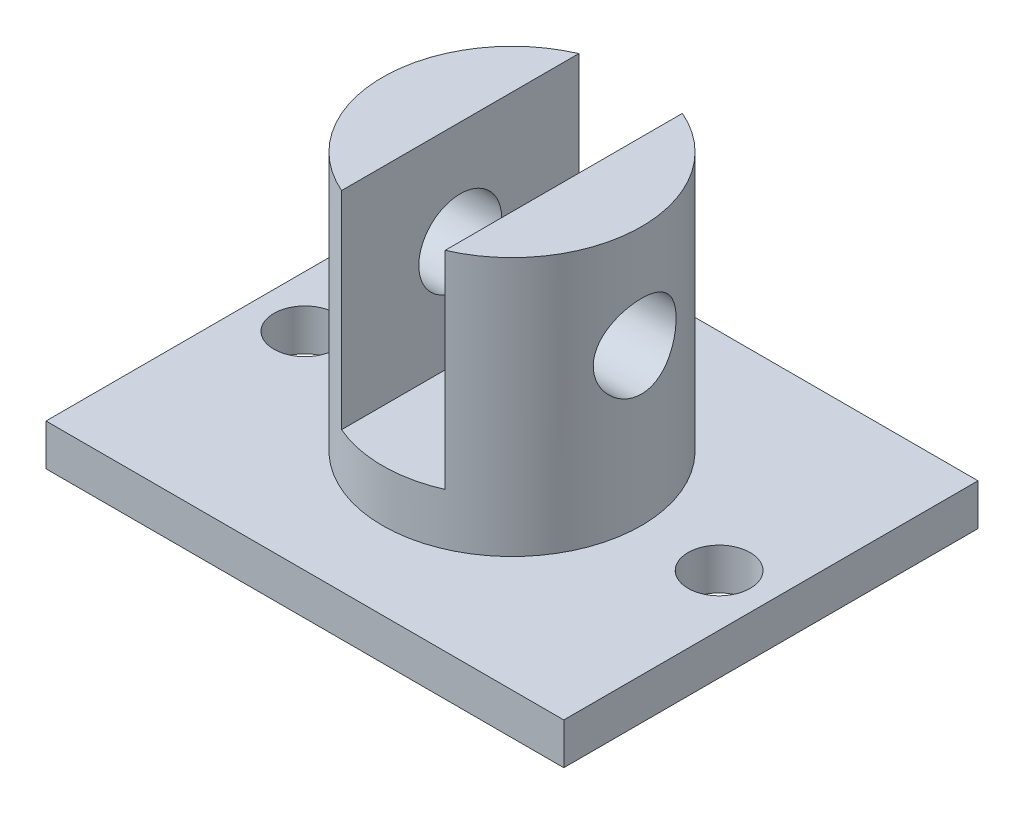
ISO-10303-21;
HEADER;
FILE_DESCRIPTION(('STEP AP214'),'2;1');
FILE_NAME('part.step','',(''),(''),'','','');
FILE_SCHEMA(('AUTOMOTIVE_DESIGN { 1 0 10303 214 1 1 1 1 }'));
ENDSEC;
DATA;
#1=APPLICATION_CONTEXT('core data for automotive mechanical design processes');
#2=APPLICATION_PROTOCOL_DEFINITION('international standard','automotive_design',2000,#1);
#3=PRODUCT_CONTEXT('',#1,'mechanical');
#4=PRODUCT('Part','Part','',(#3));
#5=PRODUCT_RELATED_PRODUCT_CATEGORY('part','',(#4));
#6=PRODUCT_DEFINITION_FORMATION('','',#4);
#7=PRODUCT_DEFINITION_CONTEXT('part definition',#1,'design');
#8=PRODUCT_DEFINITION('design','',#6,#7);
#9=PRODUCT_DEFINITION_SHAPE('','',#8);
#10=(LENGTH_UNIT() NAMED_UNIT(*) SI_UNIT(.MILLI.,.METRE.));
#11=(NAMED_UNIT(*) PLANE_ANGLE_UNIT() SI_UNIT($,.RADIAN.));
#12=(NAMED_UNIT(*) SI_UNIT($,.STERADIAN.) SOLID_ANGLE_UNIT());
#13=UNCERTAINTY_MEASURE_WITH_UNIT(LENGTH_MEASURE(1.E-05),#10,'distance_accuracy_value','');
#14=(GEOMETRIC_REPRESENTATION_CONTEXT(3) GLOBAL_UNCERTAINTY_ASSIGNED_CONTEXT((#13)) GLOBAL_UNIT_ASSIGNED_CONTEXT((#10,
#11,#12)) REPRESENTATION_CONTEXT('',''));
#15=CARTESIAN_POINT('',(0.,0.,0.));
#16=DIRECTION('',(0.,0.,1.));
#17=DIRECTION('',(1.,0.,0.));
#18=AXIS2_PLACEMENT_3D('',#15,#16,#17);
#19=CARTESIAN_POINT('',(0.,29.,0.));
#20=DIRECTION('',(0.,1.,0.));
#21=DIRECTION('',(0.,0.,1.));
#22=AXIS2_PLACEMENT_3D('',#19,#20,#21);
#23=PLANE('',#22);
#24=DIRECTION('',(0.,0.,-1.));
#25=VECTOR('',#24,1.);
#26=CARTESIAN_POINT('',(5.00000000000001,29.,0.));
#27=LINE('',#26,#25);
#28=CARTESIAN_POINT('',(5.00000000000001,29.,11.4564392373896));
#29=VERTEX_POINT('',#28);
#30=CARTESIAN_POINT('',(5.00000000000001,29.,-11.4564392373896));
#31=VERTEX_POINT('',#30);
#32=EDGE_CURVE('E120',#29,#31,#27,.T.);
#33=ORIENTED_EDGE('',*,*,#32,.F.);
#34=CARTESIAN_POINT('',(0.,29.,0.));
#35=DIRECTION('',(0.,1.,0.));
#36=DIRECTION('',(0.,0.,1.));
#37=AXIS2_PLACEMENT_3D('',#34,#35,#36);
#38=CIRCLE('',#37,12.5);
#39=EDGE_CURVE('E132',#29,#31,#38,.T.);
#40=ORIENTED_EDGE('',*,*,#39,.T.);
#41=EDGE_LOOP('',(#33,#40));
#42=FACE_BOUND('',#41,.T.);
#43=ADVANCED_FACE('F37',(#42),#23,.T.);
#44=CARTESIAN_POINT('',(25.,4.,-20.));
#45=DIRECTION('',(-1.,0.,0.));
#46=DIRECTION('',(0.,0.,1.));
#47=AXIS2_PLACEMENT_3D('',#44,#45,#46);
#48=PLANE('',#47);
#49=DIRECTION('',(0.,0.,-1.));
#50=VECTOR('',#49,1.);
#51=CARTESIAN_POINT('',(25.,0.,-20.));
#52=LINE('',#51,#50);
#53=CARTESIAN_POINT('',(25.,0.,20.));
#54=VERTEX_POINT('',#53);
#55=CARTESIAN_POINT('',(25.,0.,-20.));
#56=VERTEX_POINT('',#55);
#57=EDGE_CURVE('E136',#54,#56,#52,.T.);
#58=ORIENTED_EDGE('',*,*,#57,.T.);
#59=DIRECTION('',(0.,-1.,0.));
#60=VECTOR('',#59,1.);
#61=CARTESIAN_POINT('',(25.,4.,-20.));
#62=LINE('',#61,#60);
#63=CARTESIAN_POINT('',(25.,4.,-20.));
#64=VERTEX_POINT('',#63);
#65=EDGE_CURVE('E121',#64,#56,#62,.T.);
#66=ORIENTED_EDGE('',*,*,#65,.F.);
#67=DIRECTION('',(0.,0.,-1.));
#68=VECTOR('',#67,1.);
#69=CARTESIAN_POINT('',(25.,4.,-20.));
#70=LINE('',#69,#68);
#71=CARTESIAN_POINT('',(25.,4.,20.));
#72=VERTEX_POINT('',#71);
#73=EDGE_CURVE('E143',#72,#64,#70,.T.);
#74=ORIENTED_EDGE('',*,*,#73,.F.);
#75=DIRECTION('',(0.,-1.,0.));
#76=VECTOR('',#75,1.);
#77=CARTESIAN_POINT('',(25.,4.,20.));
#78=LINE('',#77,#76);
#79=EDGE_CURVE('E149',#72,#54,#78,.T.);
#80=ORIENTED_EDGE('',*,*,#79,.T.);
#81=EDGE_LOOP('',(#58,#66,#74,#80));
#82=FACE_BOUND('',#81,.T.);
#83=ADVANCED_FACE('F39',(#82),#48,.F.);
#84=CARTESIAN_POINT('',(-25.,4.,-20.));
#85=DIRECTION('',(0.,0.,1.));
#86=DIRECTION('',(1.,0.,0.));
#87=AXIS2_PLACEMENT_3D('',#84,#85,#86);
#88=PLANE('',#87);
#89=DIRECTION('',(-1.,0.,0.));
#90=VECTOR('',#89,1.);
#91=CARTESIAN_POINT('',(-25.,0.,-20.));
#92=LINE('',#91,#90);
#93=CARTESIAN_POINT('',(-25.,0.,-20.));
#94=VERTEX_POINT('',#93);
#95=EDGE_CURVE('E152',#56,#94,#92,.T.);
#96=ORIENTED_EDGE('',*,*,#95,.T.);
#97=DIRECTION('',(0.,-1.,0.));
#98=VECTOR('',#97,1.);
#99=CARTESIAN_POINT('',(-25.,4.,-20.));
#100=LINE('',#99,#98);
#101=CARTESIAN_POINT('',(-25.,4.,-20.));
#102=VERTEX_POINT('',#101);
#103=EDGE_CURVE('E160',#102,#94,#100,.T.);
#104=ORIENTED_EDGE('',*,*,#103,.F.);
#105=DIRECTION('',(-1.,0.,0.));
#106=VECTOR('',#105,1.);
#107=CARTESIAN_POINT('',(-25.,4.,-20.));
#108=LINE('',#107,#106);
#109=EDGE_CURVE('E92',#64,#102,#108,.T.);
#110=ORIENTED_EDGE('',*,*,#109,.F.);
#111=ORIENTED_EDGE('',*,*,#65,.T.);
#112=EDGE_LOOP('',(#96,#104,#110,#111));
#113=FACE_BOUND('',#112,.T.);
#114=ADVANCED_FACE('F228',(#113),#88,.F.);
#115=CARTESIAN_POINT('',(-25.,4.,-20.));
#116=DIRECTION('',(1.,0.,0.));
#117=DIRECTION('',(0.,0.,-1.));
#118=AXIS2_PLACEMENT_3D('',#115,#116,#117);
#119=PLANE('',#118);
#120=DIRECTION('',(0.,0.,1.));
#121=VECTOR('',#120,1.);
#122=CARTESIAN_POINT('',(-25.,0.,-20.));
#123=LINE('',#122,#121);
#124=CARTESIAN_POINT('',(-25.,0.,20.));
#125=VERTEX_POINT('',#124);
#126=EDGE_CURVE('E154',#94,#125,#123,.T.);
#127=ORIENTED_EDGE('',*,*,#126,.T.);
#128=DIRECTION('',(0.,-1.,0.));
#129=VECTOR('',#128,1.);
#130=CARTESIAN_POINT('',(-25.,4.,20.));
#131=LINE('',#130,#129);
#132=CARTESIAN_POINT('',(-25.,4.,20.));
#133=VERTEX_POINT('',#132);
#134=EDGE_CURVE('E158',#133,#125,#131,.T.);
#135=ORIENTED_EDGE('',*,*,#134,.F.);
#136=DIRECTION('',(0.,0.,1.));
#137=VECTOR('',#136,1.);
#138=CARTESIAN_POINT('',(-25.,4.,-20.));
#139=LINE('',#138,#137);
#140=EDGE_CURVE('E146',#102,#133,#139,.T.);
#141=ORIENTED_EDGE('',*,*,#140,.F.);
#142=ORIENTED_EDGE('',*,*,#103,.T.);
#143=EDGE_LOOP('',(#127,#135,#141,#142));
#144=FACE_BOUND('',#143,.T.);
#145=ADVANCED_FACE('F277',(#144),#119,.F.);
#146=CARTESIAN_POINT('',(-25.,4.,20.));
#147=DIRECTION('',(0.,0.,-1.));
#148=DIRECTION('',(-1.,0.,0.));
#149=AXIS2_PLACEMENT_3D('',#146,#147,#148);
#150=PLANE('',#149);
#151=DIRECTION('',(1.,0.,0.));
#152=VECTOR('',#151,1.);
#153=CARTESIAN_POINT('',(-25.,0.,20.));
#154=LINE('',#153,#152);
#155=EDGE_CURVE('E84',#125,#54,#154,.T.);
#156=ORIENTED_EDGE('',*,*,#155,.T.);
#157=ORIENTED_EDGE('',*,*,#79,.F.);
#158=DIRECTION('',(1.,0.,0.));
#159=VECTOR('',#158,1.);
#160=CARTESIAN_POINT('',(-25.,4.,20.));
#161=LINE('',#160,#159);
#162=EDGE_CURVE('E63',#133,#72,#161,.T.);
#163=ORIENTED_EDGE('',*,*,#162,.F.);
#164=ORIENTED_EDGE('',*,*,#134,.T.);
#165=EDGE_LOOP('',(#156,#157,#163,#164));
#166=FACE_BOUND('',#165,.T.);
#167=ADVANCED_FACE('F273',(#166),#150,.F.);
#168=CARTESIAN_POINT('',(0.,4.,0.));
#169=DIRECTION('',(0.,1.,0.));
#170=DIRECTION('',(0.,0.,1.));
#171=AXIS2_PLACEMENT_3D('',#168,#169,#170);
#172=PLANE('',#171);
#173=CARTESIAN_POINT('',(20.,4.,0.));
#174=DIRECTION('',(0.,1.,0.));
#175=DIRECTION('',(0.,0.,1.));
#176=AXIS2_PLACEMENT_3D('',#173,#174,#175);
#177=CIRCLE('',#176,3.);
#178=CARTESIAN_POINT('',(20.,4.,3.));
#179=VERTEX_POINT('',#178);
#180=EDGE_CURVE('E178',#179,#179,#177,.T.);
#181=ORIENTED_EDGE('',*,*,#180,.F.);
#182=EDGE_LOOP('',(#181));
#183=FACE_BOUND('',#182,.T.);
#184=CARTESIAN_POINT('',(-20.0000000000051,4.,0.));
#185=DIRECTION('',(0.,1.,0.));
#186=DIRECTION('',(0.,0.,1.));
#187=AXIS2_PLACEMENT_3D('',#184,#185,#186);
#188=CIRCLE('',#187,3.);
#189=CARTESIAN_POINT('',(-20.0000000000051,4.,3.));
#190=VERTEX_POINT('',#189);
#191=EDGE_CURVE('E170',#190,#190,#188,.T.);
#192=ORIENTED_EDGE('',*,*,#191,.F.);
#193=EDGE_LOOP('',(#192));
#194=FACE_BOUND('',#193,.T.);
#195=CARTESIAN_POINT('',(0.,4.,0.));
#196=DIRECTION('',(0.,1.,0.));
#197=DIRECTION('',(0.,0.,1.));
#198=AXIS2_PLACEMENT_3D('',#195,#196,#197);
#199=CIRCLE('',#198,12.5);
#200=CARTESIAN_POINT('',(0.,4.,12.5));
#201=VERTEX_POINT('',#200);
#202=EDGE_CURVE('E133',#201,#201,#199,.T.);
#203=ORIENTED_EDGE('',*,*,#202,.F.);
#204=EDGE_LOOP('',(#203));
#205=FACE_BOUND('',#204,.T.);
#206=ORIENTED_EDGE('',*,*,#73,.T.);
#207=ORIENTED_EDGE('',*,*,#109,.T.);
#208=ORIENTED_EDGE('',*,*,#140,.T.);
#209=ORIENTED_EDGE('',*,*,#162,.T.);
#210=EDGE_LOOP('',(#206,#207,#208,#209));
#211=FACE_BOUND('',#210,.T.);
#212=ADVANCED_FACE('F266',(#183,#194,#205,#211),#172,.T.);
#213=CARTESIAN_POINT('',(0.,0.,0.));
#214=DIRECTION('',(0.,1.,0.));
#215=DIRECTION('',(0.,0.,1.));
#216=AXIS2_PLACEMENT_3D('',#213,#214,#215);
#217=PLANE('',#216);
#218=CARTESIAN_POINT('',(20.,0.,0.));
#219=DIRECTION('',(0.,1.,0.));
#220=DIRECTION('',(0.,0.,1.));
#221=AXIS2_PLACEMENT_3D('',#218,#219,#220);
#222=CIRCLE('',#221,3.);
#223=CARTESIAN_POINT('',(20.,0.,3.));
#224=VERTEX_POINT('',#223);
#225=EDGE_CURVE('E41',#224,#224,#222,.T.);
#226=ORIENTED_EDGE('',*,*,#225,.T.);
#227=EDGE_LOOP('',(#226));
#228=FACE_BOUND('',#227,.T.);
#229=CARTESIAN_POINT('',(-20.0000000000051,0.,0.));
#230=DIRECTION('',(0.,1.,0.));
#231=DIRECTION('',(0.,0.,1.));
#232=AXIS2_PLACEMENT_3D('',#229,#230,#231);
#233=CIRCLE('',#232,3.);
#234=CARTESIAN_POINT('',(-20.0000000000051,0.,3.));
#235=VERTEX_POINT('',#234);
#236=EDGE_CURVE('E168',#235,#235,#233,.T.);
#237=ORIENTED_EDGE('',*,*,#236,.T.);
#238=EDGE_LOOP('',(#237));
#239=FACE_BOUND('',#238,.T.);
#240=ORIENTED_EDGE('',*,*,#57,.F.);
#241=ORIENTED_EDGE('',*,*,#155,.F.);
#242=ORIENTED_EDGE('',*,*,#126,.F.);
#243=ORIENTED_EDGE('',*,*,#95,.F.);
#244=EDGE_LOOP('',(#240,#241,#242,#243));
#245=FACE_BOUND('',#244,.T.);
#246=ADVANCED_FACE('F221',(#228,#239,#245),#217,.F.);
#247=CARTESIAN_POINT('',(0.,29.,0.));
#248=DIRECTION('',(0.,-1.,0.));
#249=DIRECTION('',(0.,0.,-1.));
#250=AXIS2_PLACEMENT_3D('',#247,#248,#249);
#251=CYLINDRICAL_SURFACE('',#250,12.5);
#252=CARTESIAN_POINT('',(-11.842719282327,19.,-4.));
#253=CARTESIAN_POINT('',(-11.8427199699566,19.2184155949729,-3.99999935935302));
#254=CARTESIAN_POINT('',(-11.8488277399487,19.4368387593864,-3.98204982916322));
#255=CARTESIAN_POINT('',(-11.8724842974625,19.8672489690504,-3.91094422931103));
#256=CARTESIAN_POINT('',(-11.8900357393061,20.0792345091736,-3.85777999166795));
#257=CARTESIAN_POINT('',(-11.9343925365716,20.4904702541019,-3.71827554706383));
#258=CARTESIAN_POINT('',(-11.9611808918508,20.6897430632552,-3.63199625417291));
#259=CARTESIAN_POINT('',(-12.0209691387475,21.0710441025551,-3.42891586136008));
#260=CARTESIAN_POINT('',(-12.0539702268166,21.2530690009217,-3.3121088807135));
#261=CARTESIAN_POINT('',(-12.1237992191192,21.6012659878293,-3.04678104882872));
#262=CARTESIAN_POINT('',(-12.1607169507637,21.7667254136869,-2.89734836823298));
#263=CARTESIAN_POINT('',(-12.2334570053411,22.0707160646597,-2.57296030582542));
#264=CARTESIAN_POINT('',(-12.269279166812,22.2092433365555,-2.39800118371827));
#265=CARTESIAN_POINT('',(-12.3368238271391,22.45861346325,-2.02237355615693));
#266=CARTESIAN_POINT('',(-12.3684282786178,22.5687178732731,-1.82119171965248));
#267=CARTESIAN_POINT('',(-12.4229242661366,22.7532464099141,-1.40198048377137));
#268=CARTESIAN_POINT('',(-12.4458179551613,22.8276793544067,-1.18395526351671));
#269=CARTESIAN_POINT('',(-12.479676950379,22.9363594480709,-0.744711775297693));
#270=CARTESIAN_POINT('',(-12.4910032748545,22.971825644154,-0.523823472185483));
#271=CARTESIAN_POINT('',(-12.5017287029849,23.0054327637528,-0.0789603248012289));
#272=CARTESIAN_POINT('',(-12.5011306457409,23.0035825720045,0.145013772077128));
#273=CARTESIAN_POINT('',(-12.4883236997896,22.9634012450691,0.581093729167384));
#274=CARTESIAN_POINT('',(-12.4765357034484,22.9263925053985,0.79333579075878));
#275=CARTESIAN_POINT('',(-12.4431948493389,22.8191204418971,1.20842073412411));
#276=CARTESIAN_POINT('',(-12.4216413449197,22.7488549158599,1.41126299248278));
#277=CARTESIAN_POINT('',(-12.3706365500491,22.5762419187057,1.80478487403707));
#278=CARTESIAN_POINT('',(-12.3410893332516,22.473502046017,1.99527942968321));
#279=CARTESIAN_POINT('',(-12.2771970855205,22.2391744827527,2.35672859352838));
#280=CARTESIAN_POINT('',(-12.2428507979634,22.1075792313199,2.52767806251326));
#281=CARTESIAN_POINT('',(-12.1712367294856,21.8125308956707,2.8530638131067));
#282=CARTESIAN_POINT('',(-12.1339068619231,21.6479390923703,3.00645534449559));
#283=CARTESIAN_POINT('',(-12.0618145989439,21.2950293475369,3.28378018395939));
#284=CARTESIAN_POINT('',(-12.0270525377475,21.1067083260587,3.40770966195435));
#285=CARTESIAN_POINT('',(-11.9637089339779,20.7086081493091,3.62388810953954));
#286=CARTESIAN_POINT('',(-11.9352081440021,20.498594811739,3.71573126088371));
#287=CARTESIAN_POINT('',(-11.8885562852076,20.0649479842031,3.8624115437165));
#288=CARTESIAN_POINT('',(-11.8704012824717,19.8413197070774,3.91726274260851));
#289=CARTESIAN_POINT('',(-11.8473757948988,19.3968402247348,3.98634732980607));
#290=CARTESIAN_POINT('',(-11.8419801089925,19.1762658791782,4.0021876938619));
#291=CARTESIAN_POINT('',(-11.8436224693089,18.7355893236636,3.99732669767184));
#292=CARTESIAN_POINT('',(-11.8506584784444,18.515487042269,3.97663132425953));
#293=CARTESIAN_POINT('',(-11.8758511036107,18.0890574316382,3.90072533361949));
#294=CARTESIAN_POINT('',(-11.8936586123319,17.8825146332527,3.84659716428486));
#295=CARTESIAN_POINT('',(-11.9380128770361,17.4814721006504,3.70664280725108));
#296=CARTESIAN_POINT('',(-11.9645611032884,17.2869743990738,3.62081128645948));
#297=CARTESIAN_POINT('',(-12.0243860591649,16.9091303820954,3.41697396012587));
#298=CARTESIAN_POINT('',(-12.0578396098649,16.7262886029767,3.29808617389175));
#299=CARTESIAN_POINT('',(-12.1273479833206,16.3825664445406,3.03252999413197));
#300=CARTESIAN_POINT('',(-12.1634035126375,16.2216920649792,2.88585403708636));
#301=CARTESIAN_POINT('',(-12.2359628130699,15.9192022234145,2.56125244512296));
#302=CARTESIAN_POINT('',(-12.2724171226716,15.7787379960407,2.38223997872511));
#303=CARTESIAN_POINT('',(-12.3400966382304,15.5297873068082,2.00229721221567));
#304=CARTESIAN_POINT('',(-12.3713220674134,15.4212994796963,1.80136784836229));
#305=CARTESIAN_POINT('',(-12.4248572290492,15.2404100068307,1.38445940226065));
#306=CARTESIAN_POINT('',(-12.4472294035216,15.1677547039656,1.16859881389167));
#307=CARTESIAN_POINT('',(-12.480810616577,15.0600397397232,0.726874957063006));
#308=CARTESIAN_POINT('',(-12.4920233359687,15.0249676816827,0.501015012458267));
#309=CARTESIAN_POINT('',(-12.5017663129826,14.9944607302506,0.0562765879062623));
#310=CARTESIAN_POINT('',(-12.5008274477244,14.9973667124253,-0.162477761236098));
#311=CARTESIAN_POINT('',(-12.4876568899275,15.0386927119456,-0.596238594775698));
#312=CARTESIAN_POINT('',(-12.4754259954572,15.0771102195009,-0.811245342941921));
#313=CARTESIAN_POINT('',(-12.4412233539435,15.1872956769149,-1.22850760398064));
#314=CARTESIAN_POINT('',(-12.4193869374855,15.2586009311141,-1.4308971714329));
#315=CARTESIAN_POINT('',(-12.3682230993078,15.4321165239307,-1.82093134276042));
#316=CARTESIAN_POINT('',(-12.3388943647058,15.5343322795866,-2.00857335487159));
#317=CARTESIAN_POINT('',(-12.2745138549376,15.7709027694635,-2.37094464163666));
#318=CARTESIAN_POINT('',(-12.2392975634481,15.906258090511,-2.54499113183174));
#319=CARTESIAN_POINT('',(-12.1675595998111,16.2035231896009,-2.86844801950664));
#320=CARTESIAN_POINT('',(-12.1310375306124,16.3654410992352,-3.01785084465771));
#321=CARTESIAN_POINT('',(-12.0592883124172,16.7180666140904,-3.29310491309765));
#322=CARTESIAN_POINT('',(-12.0241521106559,16.9095875051786,-3.41794102245578));
#323=CARTESIAN_POINT('',(-11.9607741956668,17.3119617641823,-3.63353471705189));
#324=CARTESIAN_POINT('',(-11.9325300332104,17.5228082276068,-3.72430441468119));
#325=CARTESIAN_POINT('',(-11.8881467072458,17.9424571027708,-3.86354015966022));
#326=CARTESIAN_POINT('',(-11.8712893448615,18.1503378897143,-3.91455627646292));
#327=CARTESIAN_POINT('',(-11.8485768271906,18.5721444970475,-3.98278180434112));
#328=CARTESIAN_POINT('',(-11.8427186088149,18.7860686176136,-4.00000062749409));
#329=CARTESIAN_POINT('',(-11.842719282327,19.,-4.));
#330=B_SPLINE_CURVE_WITH_KNOTS('',3,(#252,#253,#254,#255,#256,#257,#258,#259,#260,#261,#262,
#263,#264,#265,#266,#267,#268,#269,#270,#271,#272,#273,#274,#275,#276,#277,#278,#279,#280,#281,
#282,#283,#284,#285,#286,#287,#288,#289,#290,#291,#292,#293,#294,#295,#296,#297,#298,#299,#300,
#301,#302,#303,#304,#305,#306,#307,#308,#309,#310,#311,#312,#313,#314,#315,#316,#317,#318,#319,
#320,#321,#322,#323,#324,#325,#326,#327,#328,#329),.UNSPECIFIED.,.T.,.F.,(4,2,2,2,2,2,2,2,2,2,2,
2,2,2,2,2,2,2,2,2,2,2,2,2,2,2,2,2,2,2,2,2,2,2,2,2,2,2,4),(0.,0.654455842715349,1.309063538331,
1.96247283098348,2.6160080865338,3.29090543042416,3.96590176403352,4.65698443727681,
5.34789618881212,6.01651686048925,6.68497834076492,7.32925318507043,7.97357069810019,
8.62599225189614,9.27858496176539,9.95962670810641,10.6407569418194,11.3302140454822,
12.0194088123988,12.6796997833962,13.3398825675735,13.979736408686,14.6196979341528,
15.2787163323882,15.9379143638459,16.6259668097989,17.3139898746478,17.9970699222358,
18.6799245895442,19.3330513205858,19.9861318951797,20.6302921470087,21.2745653528473,
21.9414122843778,22.6084637396799,23.2990150253329,23.9893205507532,24.6305185843684,
25.2715380278761),.UNSPECIFIED.);
#331=CARTESIAN_POINT('',(-11.842719282327,19.,-4.));
#332=VERTEX_POINT('',#331);
#333=EDGE_CURVE('E190',#332,#332,#330,.T.);
#334=ORIENTED_EDGE('',*,*,#333,.T.);
#335=EDGE_LOOP('',(#334));
#336=FACE_BOUND('',#335,.T.);
#337=CARTESIAN_POINT('',(11.842719282327,19.,-4.));
#338=CARTESIAN_POINT('',(11.8427199699566,18.7815844050271,-3.99999935935302));
#339=CARTESIAN_POINT('',(11.8488277399487,18.5631612406136,-3.98204982916322));
#340=CARTESIAN_POINT('',(11.8724842974625,18.1327510309496,-3.91094422931103));
#341=CARTESIAN_POINT('',(11.8900357393061,17.9207654908265,-3.85777999166795));
#342=CARTESIAN_POINT('',(11.9343925365716,17.5095297458981,-3.71827554706383));
#343=CARTESIAN_POINT('',(11.9611808918508,17.3102569367448,-3.6319962541729));
#344=CARTESIAN_POINT('',(12.0209691387475,16.9289558974449,-3.42891586136007));
#345=CARTESIAN_POINT('',(12.0539702268166,16.7469309990783,-3.3121088807135));
#346=CARTESIAN_POINT('',(12.1237992191192,16.3987340121707,-3.04678104882872));
#347=CARTESIAN_POINT('',(12.1607169507637,16.2332745863131,-2.89734836823298));
#348=CARTESIAN_POINT('',(12.2334570053411,15.9292839353403,-2.57296030582542));
#349=CARTESIAN_POINT('',(12.269279166812,15.7907566634445,-2.39800118371827));
#350=CARTESIAN_POINT('',(12.3368238271391,15.54138653675,-2.02237355615693));
#351=CARTESIAN_POINT('',(12.3684282786178,15.4312821267269,-1.82119171965248));
#352=CARTESIAN_POINT('',(12.4229242661366,15.2467535900859,-1.40198048377137));
#353=CARTESIAN_POINT('',(12.4458179551613,15.1723206455933,-1.18395526351671));
#354=CARTESIAN_POINT('',(12.479676950379,15.0636405519291,-0.744711775297694));
#355=CARTESIAN_POINT('',(12.4910032748545,15.028174355846,-0.523823472185484));
#356=CARTESIAN_POINT('',(12.5017287029849,14.9945672362472,-0.0789603248012301));
#357=CARTESIAN_POINT('',(12.5011306457409,14.9964174279955,0.145013772077127));
#358=CARTESIAN_POINT('',(12.4883236997896,15.0365987549309,0.581093729167384));
#359=CARTESIAN_POINT('',(12.4765357034484,15.0736074946015,0.79333579075878));
#360=CARTESIAN_POINT('',(12.4431948493389,15.1808795581029,1.20842073412411));
#361=CARTESIAN_POINT('',(12.4216413449197,15.2511450841401,1.41126299248278));
#362=CARTESIAN_POINT('',(12.3706365500491,15.4237580812943,1.80478487403707));
#363=CARTESIAN_POINT('',(12.3410893332516,15.526497953983,1.99527942968321));
#364=CARTESIAN_POINT('',(12.2771970855205,15.7608255172473,2.35672859352838));
#365=CARTESIAN_POINT('',(12.2428507979634,15.8924207686801,2.52767806251326));
#366=CARTESIAN_POINT('',(12.1712367294856,16.1874691043293,2.8530638131067));
#367=CARTESIAN_POINT('',(12.1339068619231,16.3520609076297,3.00645534449559));
#368=CARTESIAN_POINT('',(12.0618145989439,16.7049706524631,3.28378018395939));
#369=CARTESIAN_POINT('',(12.0270525377475,16.8932916739413,3.40770966195435));
#370=CARTESIAN_POINT('',(11.9637089339779,17.2913918506909,3.62388810953954));
#371=CARTESIAN_POINT('',(11.9352081440021,17.501405188261,3.71573126088371));
#372=CARTESIAN_POINT('',(11.8885562852076,17.9350520157969,3.8624115437165));
#373=CARTESIAN_POINT('',(11.8704012824717,18.1586802929226,3.91726274260851));
#374=CARTESIAN_POINT('',(11.8473757948988,18.6031597752652,3.98634732980607));
#375=CARTESIAN_POINT('',(11.8419801089925,18.8237341208218,4.0021876938619));
#376=CARTESIAN_POINT('',(11.8436224693089,19.2644106763364,3.99732669767184));
#377=CARTESIAN_POINT('',(11.8506584784444,19.484512957731,3.97663132425953));
#378=CARTESIAN_POINT('',(11.8758511036107,19.9109425683618,3.90072533361949));
#379=CARTESIAN_POINT('',(11.8936586123319,20.1174853667473,3.84659716428486));
#380=CARTESIAN_POINT('',(11.9380128770361,20.5185278993496,3.70664280725108));
#381=CARTESIAN_POINT('',(11.9645611032884,20.7130256009262,3.62081128645948));
#382=CARTESIAN_POINT('',(12.0243860591649,21.0908696179046,3.41697396012587));
#383=CARTESIAN_POINT('',(12.0578396098649,21.2737113970233,3.29808617389175));
#384=CARTESIAN_POINT('',(12.1273479833206,21.6174335554594,3.03252999413196));
#385=CARTESIAN_POINT('',(12.1634035126375,21.7783079350208,2.88585403708636));
#386=CARTESIAN_POINT('',(12.2359628130699,22.0807977765855,2.56125244512296));
#387=CARTESIAN_POINT('',(12.2724171226716,22.2212620039593,2.38223997872511));
#388=CARTESIAN_POINT('',(12.3400966382304,22.4702126931918,2.00229721221567));
#389=CARTESIAN_POINT('',(12.3713220674134,22.5787005203037,1.80136784836229));
#390=CARTESIAN_POINT('',(12.4248572290492,22.7595899931693,1.38445940226065));
#391=CARTESIAN_POINT('',(12.4472294035216,22.8322452960344,1.16859881389167));
#392=CARTESIAN_POINT('',(12.480810616577,22.9399602602768,0.726874957063006));
#393=CARTESIAN_POINT('',(12.4920233359687,22.9750323183173,0.501015012458268));
#394=CARTESIAN_POINT('',(12.5017663129826,23.0055392697494,0.0562765879062625));
#395=CARTESIAN_POINT('',(12.5008274477244,23.0026332875747,-0.162477761236097));
#396=CARTESIAN_POINT('',(12.4876568899275,22.9613072880544,-0.596238594775698));
#397=CARTESIAN_POINT('',(12.4754259954572,22.9228897804991,-0.811245342941921));
#398=CARTESIAN_POINT('',(12.4412233539435,22.8127043230851,-1.22850760398064));
#399=CARTESIAN_POINT('',(12.4193869374855,22.7413990688859,-1.4308971714329));
#400=CARTESIAN_POINT('',(12.3682230993078,22.5678834760693,-1.82093134276042));
#401=CARTESIAN_POINT('',(12.3388943647058,22.4656677204134,-2.00857335487159));
#402=CARTESIAN_POINT('',(12.2745138549376,22.2290972305365,-2.37094464163666));
#403=CARTESIAN_POINT('',(12.2392975634481,22.093741909489,-2.54499113183174));
#404=CARTESIAN_POINT('',(12.1675595998111,21.7964768103991,-2.86844801950664));
#405=CARTESIAN_POINT('',(12.1310375306124,21.6345589007648,-3.01785084465771));
#406=CARTESIAN_POINT('',(12.0592883124172,21.2819333859096,-3.29310491309765));
#407=CARTESIAN_POINT('',(12.0241521106559,21.0904124948214,-3.41794102245578));
#408=CARTESIAN_POINT('',(11.9607741956668,20.6880382358177,-3.63353471705189));
#409=CARTESIAN_POINT('',(11.9325300332104,20.4771917723932,-3.72430441468119));
#410=CARTESIAN_POINT('',(11.8881467072458,20.0575428972292,-3.86354015966022));
#411=CARTESIAN_POINT('',(11.8712893448615,19.8496621102857,-3.91455627646292));
#412=CARTESIAN_POINT('',(11.8485768271906,19.4278555029525,-3.98278180434112));
#413=CARTESIAN_POINT('',(11.8427186088149,19.2139313823864,-4.00000062749409));
#414=CARTESIAN_POINT('',(11.842719282327,19.,-4.));
#415=B_SPLINE_CURVE_WITH_KNOTS('',3,(#337,#338,#339,#340,#341,#342,#343,#344,#345,#346,#347,
#348,#349,#350,#351,#352,#353,#354,#355,#356,#357,#358,#359,#360,#361,#362,#363,#364,#365,#366,
#367,#368,#369,#370,#371,#372,#373,#374,#375,#376,#377,#378,#379,#380,#381,#382,#383,#384,#385,
#386,#387,#388,#389,#390,#391,#392,#393,#394,#395,#396,#397,#398,#399,#400,#401,#402,#403,#404,
#405,#406,#407,#408,#409,#410,#411,#412,#413,#414),.UNSPECIFIED.,.T.,.F.,(4,2,2,2,2,2,2,2,2,2,2,
2,2,2,2,2,2,2,2,2,2,2,2,2,2,2,2,2,2,2,2,2,2,2,2,2,2,2,4),(0.,0.654455842715349,1.309063538331,
1.96247283098349,2.6160080865338,3.29090543042416,3.96590176403352,4.65698443727681,
5.34789618881212,6.01651686048925,6.68497834076492,7.32925318507043,7.97357069810019,
8.62599225189614,9.27858496176539,9.95962670810641,10.6407569418194,11.3302140454822,
12.0194088123988,12.6796997833962,13.3398825675735,13.979736408686,14.6196979341528,
15.2787163323882,15.9379143638459,16.6259668097989,17.3139898746478,17.9970699222358,
18.6799245895443,19.3330513205858,19.9861318951797,20.6302921470087,21.2745653528473,
21.9414122843778,22.6084637396799,23.2990150253329,23.9893205507533,24.6305185843684,
25.2715380278761),.UNSPECIFIED.);
#416=CARTESIAN_POINT('',(11.842719282327,19.,-4.));
#417=VERTEX_POINT('',#416);
#418=EDGE_CURVE('E183',#417,#417,#415,.T.);
#419=ORIENTED_EDGE('',*,*,#418,.T.);
#420=EDGE_LOOP('',(#419));
#421=FACE_BOUND('',#420,.T.);
#422=CARTESIAN_POINT('',(0.,9.,0.));
#423=DIRECTION('',(0.,-1.,0.));
#424=DIRECTION('',(0.,0.,-1.));
#425=AXIS2_PLACEMENT_3D('',#422,#423,#424);
#426=CIRCLE('',#425,12.5);
#427=CARTESIAN_POINT('',(-4.99999999999999,9.,-11.4564392373896));
#428=VERTEX_POINT('',#427);
#429=CARTESIAN_POINT('',(5.00000000000002,9.,-11.4564392373896));
#430=VERTEX_POINT('',#429);
#431=EDGE_CURVE('E11',#428,#430,#426,.T.);
#432=ORIENTED_EDGE('',*,*,#431,.T.);
#433=DIRECTION('',(0.,-1.,0.));
#434=VECTOR('',#433,1.);
#435=CARTESIAN_POINT('',(5.00000000000001,29.,-11.4564392373896));
#436=LINE('',#435,#434);
#437=EDGE_CURVE('E234',#430,#31,#436,.F.);
#438=ORIENTED_EDGE('',*,*,#437,.T.);
#439=ORIENTED_EDGE('',*,*,#39,.F.);
#440=DIRECTION('',(0.,-1.,0.));
#441=VECTOR('',#440,1.);
#442=CARTESIAN_POINT('',(5.00000000000001,29.,11.4564392373896));
#443=LINE('',#442,#441);
#444=CARTESIAN_POINT('',(5.00000000000002,9.,11.4564392373896));
#445=VERTEX_POINT('',#444);
#446=EDGE_CURVE('E138',#29,#445,#443,.T.);
#447=ORIENTED_EDGE('',*,*,#446,.T.);
#448=CARTESIAN_POINT('',(-4.99999999999999,9.,11.4564392373896));
#449=VERTEX_POINT('',#448);
#450=EDGE_CURVE('E46',#445,#449,#426,.T.);
#451=ORIENTED_EDGE('',*,*,#450,.T.);
#452=DIRECTION('',(0.,-1.,0.));
#453=VECTOR('',#452,1.);
#454=CARTESIAN_POINT('',(-4.99999999999999,29.,11.4564392373896));
#455=LINE('',#454,#453);
#456=CARTESIAN_POINT('',(-4.99999999999999,29.,11.4564392373896));
#457=VERTEX_POINT('',#456);
#458=EDGE_CURVE('E115',#449,#457,#455,.F.);
#459=ORIENTED_EDGE('',*,*,#458,.T.);
#460=CARTESIAN_POINT('',(-4.99999999999999,29.,-11.4564392373896));
#461=VERTEX_POINT('',#460);
#462=EDGE_CURVE('E127',#461,#457,#38,.T.);
#463=ORIENTED_EDGE('',*,*,#462,.F.);
#464=DIRECTION('',(0.,-1.,0.));
#465=VECTOR('',#464,1.);
#466=CARTESIAN_POINT('',(-4.99999999999999,29.,-11.4564392373896));
#467=LINE('',#466,#465);
#468=EDGE_CURVE('E54',#461,#428,#467,.T.);
#469=ORIENTED_EDGE('',*,*,#468,.T.);
#470=EDGE_LOOP('',(#432,#438,#439,#447,#451,#459,#463,#469));
#471=FACE_BOUND('',#470,.T.);
#472=ORIENTED_EDGE('',*,*,#202,.T.);
#473=EDGE_LOOP('',(#472));
#474=FACE_BOUND('',#473,.T.);
#475=ADVANCED_FACE('F125',(#336,#421,#471,#474),#251,.T.);
#476=DIRECTION('',(0.,0.,1.));
#477=VECTOR('',#476,1.);
#478=CARTESIAN_POINT('',(-4.99999999999999,29.,0.));
#479=LINE('',#478,#477);
#480=EDGE_CURVE('E112',#461,#457,#479,.T.);
#481=ORIENTED_EDGE('',*,*,#480,.F.);
#482=ORIENTED_EDGE('',*,*,#462,.T.);
#483=EDGE_LOOP('',(#481,#482));
#484=FACE_BOUND('',#483,.T.);
#485=ADVANCED_FACE('F131',(#484),#23,.T.);
#486=CARTESIAN_POINT('',(-4.99999999999999,9.,-20.));
#487=DIRECTION('',(0.,-1.,0.));
#488=DIRECTION('',(0.,0.,-1.));
#489=AXIS2_PLACEMENT_3D('',#486,#487,#488);
#490=PLANE('',#489);
#491=DIRECTION('',(0.,0.,1.));
#492=VECTOR('',#491,1.);
#493=CARTESIAN_POINT('',(5.00000000000002,9.,-20.));
#494=LINE('',#493,#492);
#495=EDGE_CURVE('E129',#430,#445,#494,.T.);
#496=ORIENTED_EDGE('',*,*,#495,.F.);
#497=ORIENTED_EDGE('',*,*,#431,.F.);
#498=DIRECTION('',(0.,0.,1.));
#499=VECTOR('',#498,1.);
#500=CARTESIAN_POINT('',(-4.99999999999999,9.,-20.));
#501=LINE('',#500,#499);
#502=EDGE_CURVE('E239',#428,#449,#501,.T.);
#503=ORIENTED_EDGE('',*,*,#502,.T.);
#504=ORIENTED_EDGE('',*,*,#450,.F.);
#505=EDGE_LOOP('',(#496,#497,#503,#504));
#506=FACE_BOUND('',#505,.T.);
#507=ADVANCED_FACE('F206',(#506),#490,.F.);
#508=CARTESIAN_POINT('',(5.00000000000001,29.,-20.));
#509=DIRECTION('',(1.,0.,0.));
#510=DIRECTION('',(0.,1.,0.));
#511=AXIS2_PLACEMENT_3D('',#508,#509,#510);
#512=PLANE('',#511);
#513=CARTESIAN_POINT('',(5.00000000000001,19.,0.));
#514=DIRECTION('',(1.,0.,0.));
#515=DIRECTION('',(0.,1.,0.));
#516=AXIS2_PLACEMENT_3D('',#513,#514,#515);
#517=CIRCLE('',#516,4.);
#518=CARTESIAN_POINT('',(5.00000000000001,23.,0.));
#519=VERTEX_POINT('',#518);
#520=EDGE_CURVE('E167',#519,#519,#517,.T.);
#521=ORIENTED_EDGE('',*,*,#520,.T.);
#522=EDGE_LOOP('',(#521));
#523=FACE_BOUND('',#522,.T.);
#524=ORIENTED_EDGE('',*,*,#32,.T.);
#525=ORIENTED_EDGE('',*,*,#437,.F.);
#526=ORIENTED_EDGE('',*,*,#495,.T.);
#527=ORIENTED_EDGE('',*,*,#446,.F.);
#528=EDGE_LOOP('',(#524,#525,#526,#527));
#529=FACE_BOUND('',#528,.T.);
#530=ADVANCED_FACE('F210',(#523,#529),#512,.F.);
#531=CARTESIAN_POINT('',(-4.99999999999999,29.,-20.));
#532=DIRECTION('',(-1.,0.,0.));
#533=DIRECTION('',(0.,-1.,0.));
#534=AXIS2_PLACEMENT_3D('',#531,#532,#533);
#535=PLANE('',#534);
#536=CARTESIAN_POINT('',(-4.99999999999999,19.,0.));
#537=DIRECTION('',(-1.,0.,0.));
#538=DIRECTION('',(0.,-1.,0.));
#539=AXIS2_PLACEMENT_3D('',#536,#537,#538);
#540=CIRCLE('',#539,4.);
#541=CARTESIAN_POINT('',(-4.99999999999999,15.,0.));
#542=VERTEX_POINT('',#541);
#543=EDGE_CURVE('E165',#542,#542,#540,.T.);
#544=ORIENTED_EDGE('',*,*,#543,.T.);
#545=EDGE_LOOP('',(#544));
#546=FACE_BOUND('',#545,.T.);
#547=ORIENTED_EDGE('',*,*,#480,.T.);
#548=ORIENTED_EDGE('',*,*,#458,.F.);
#549=ORIENTED_EDGE('',*,*,#502,.F.);
#550=ORIENTED_EDGE('',*,*,#468,.F.);
#551=EDGE_LOOP('',(#547,#548,#549,#550));
#552=FACE_BOUND('',#551,.T.);
#553=ADVANCED_FACE('F114',(#546,#552),#535,.F.);
#554=CARTESIAN_POINT('',(-25.,19.,0.));
#555=DIRECTION('',(1.,0.,0.));
#556=DIRECTION('',(0.,0.,-1.));
#557=AXIS2_PLACEMENT_3D('',#554,#555,#556);
#558=CYLINDRICAL_SURFACE('',#557,4.);
#559=ORIENTED_EDGE('',*,*,#543,.F.);
#560=EDGE_LOOP('',(#559));
#561=FACE_BOUND('',#560,.T.);
#562=ORIENTED_EDGE('',*,*,#333,.F.);
#563=EDGE_LOOP('',(#562));
#564=FACE_BOUND('',#563,.T.);
#565=ADVANCED_FACE('F197',(#561,#564),#558,.F.);
#566=ORIENTED_EDGE('',*,*,#520,.F.);
#567=EDGE_LOOP('',(#566));
#568=FACE_BOUND('',#567,.T.);
#569=ORIENTED_EDGE('',*,*,#418,.F.);
#570=EDGE_LOOP('',(#569));
#571=FACE_BOUND('',#570,.T.);
#572=ADVANCED_FACE('F202',(#568,#571),#558,.F.);
#573=CARTESIAN_POINT('',(-20.0000000000051,-6.,0.));
#574=DIRECTION('',(0.,1.,0.));
#575=DIRECTION('',(0.,0.,1.));
#576=AXIS2_PLACEMENT_3D('',#573,#574,#575);
#577=CYLINDRICAL_SURFACE('',#576,3.);
#578=ORIENTED_EDGE('',*,*,#191,.T.);
#579=EDGE_LOOP('',(#578));
#580=FACE_BOUND('',#579,.T.);
#581=ORIENTED_EDGE('',*,*,#236,.F.);
#582=EDGE_LOOP('',(#581));
#583=FACE_BOUND('',#582,.T.);
#584=ADVANCED_FACE('F204',(#580,#583),#577,.F.);
#585=CARTESIAN_POINT('',(20.,-6.,0.));
#586=DIRECTION('',(0.,1.,0.));
#587=DIRECTION('',(0.,0.,1.));
#588=AXIS2_PLACEMENT_3D('',#585,#586,#587);
#589=CYLINDRICAL_SURFACE('',#588,3.);
#590=ORIENTED_EDGE('',*,*,#180,.T.);
#591=EDGE_LOOP('',(#590));
#592=FACE_BOUND('',#591,.T.);
#593=ORIENTED_EDGE('',*,*,#225,.F.);
#594=EDGE_LOOP('',(#593));
#595=FACE_BOUND('',#594,.T.);
#596=ADVANCED_FACE('F251',(#592,#595),#589,.F.);
#597=CLOSED_SHELL('',(#43,#83,#114,#145,#167,#212,#246,#475,#485,#507,#530,#553,#565,#572,#584,#596));
#598=MANIFOLD_SOLID_BREP('B2',#597);
#599=ADVANCED_BREP_SHAPE_REPRESENTATION('',(#18,#598),#14);
#600=SHAPE_DEFINITION_REPRESENTATION(#9,#599);
ENDSEC;
END-ISO-10303-21;
